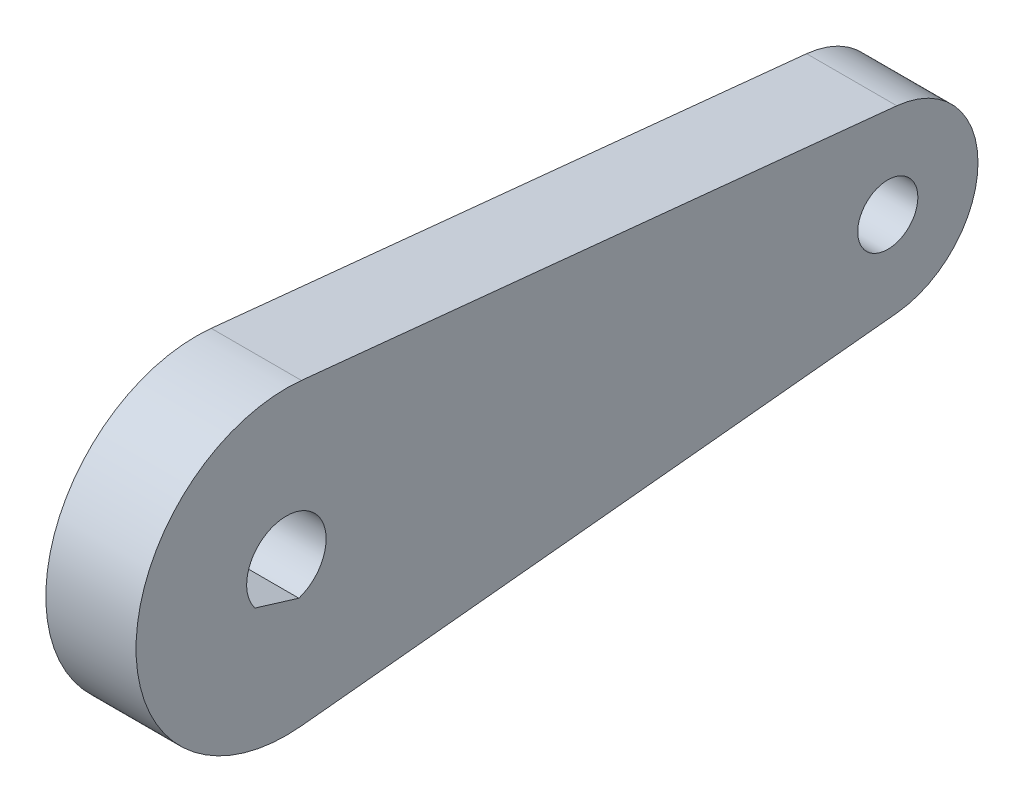
ISO-10303-21;
HEADER;
FILE_DESCRIPTION(('STEP AP214'),'2;1');
FILE_NAME('part.step','',(''),(''),'','','');
FILE_SCHEMA(('AUTOMOTIVE_DESIGN { 1 0 10303 214 1 1 1 1 }'));
ENDSEC;
DATA;
#1=APPLICATION_CONTEXT('core data for automotive mechanical design processes');
#2=APPLICATION_PROTOCOL_DEFINITION('international standard','automotive_design',2000,#1);
#3=PRODUCT_CONTEXT('',#1,'mechanical');
#4=PRODUCT('Part','Part','',(#3));
#5=PRODUCT_RELATED_PRODUCT_CATEGORY('part','',(#4));
#6=PRODUCT_DEFINITION_FORMATION('','',#4);
#7=PRODUCT_DEFINITION_CONTEXT('part definition',#1,'design');
#8=PRODUCT_DEFINITION('design','',#6,#7);
#9=PRODUCT_DEFINITION_SHAPE('','',#8);
#10=(LENGTH_UNIT() NAMED_UNIT(*) SI_UNIT(.MILLI.,.METRE.));
#11=(NAMED_UNIT(*) PLANE_ANGLE_UNIT() SI_UNIT($,.RADIAN.));
#12=(NAMED_UNIT(*) SI_UNIT($,.STERADIAN.) SOLID_ANGLE_UNIT());
#13=UNCERTAINTY_MEASURE_WITH_UNIT(LENGTH_MEASURE(1.E-05),#10,'distance_accuracy_value','');
#14=(GEOMETRIC_REPRESENTATION_CONTEXT(3) GLOBAL_UNCERTAINTY_ASSIGNED_CONTEXT((#13)) GLOBAL_UNIT_ASSIGNED_CONTEXT((#10,
#11,#12)) REPRESENTATION_CONTEXT('',''));
#15=CARTESIAN_POINT('',(0.,0.,0.));
#16=DIRECTION('',(0.,0.,1.));
#17=DIRECTION('',(1.,0.,0.));
#18=AXIS2_PLACEMENT_3D('',#15,#16,#17);
#19=CARTESIAN_POINT('',(62.4642749893234,0.,0.));
#20=DIRECTION('',(-1.,0.,0.));
#21=DIRECTION('',(0.,0.,1.));
#22=AXIS2_PLACEMENT_3D('',#19,#20,#21);
#23=CYLINDRICAL_SURFACE('',#22,10.0000000000071);
#24=CARTESIAN_POINT('',(3.,0.,0.));
#25=DIRECTION('',(1.,0.,0.));
#26=DIRECTION('',(0.,0.,-1.));
#27=AXIS2_PLACEMENT_3D('',#24,#25,#26);
#28=CIRCLE('',#27,10.0000000000071);
#29=CARTESIAN_POINT('',(3.,9.94987437101769,-1.0000000000112));
#30=VERTEX_POINT('',#29);
#31=CARTESIAN_POINT('',(3.00000000000002,-9.94987437109485,-0.99999999998613));
#32=VERTEX_POINT('',#31);
#33=EDGE_CURVE('E143',#30,#32,#28,.T.);
#34=ORIENTED_EDGE('',*,*,#33,.F.);
#35=DIRECTION('',(-1.,0.,0.));
#36=VECTOR('',#35,1.);
#37=CARTESIAN_POINT('',(62.4642749893234,9.94987437104468,-1.00000000001391));
#38=LINE('',#37,#36);
#39=CARTESIAN_POINT('',(-3.,9.94987437101769,-1.0000000000112));
#40=VERTEX_POINT('',#39);
#41=EDGE_CURVE('E135',#30,#40,#38,.T.);
#42=ORIENTED_EDGE('',*,*,#41,.T.);
#43=CARTESIAN_POINT('',(-3.,0.,0.));
#44=DIRECTION('',(1.,0.,0.));
#45=DIRECTION('',(0.,0.,-1.));
#46=AXIS2_PLACEMENT_3D('',#43,#44,#45);
#47=CIRCLE('',#46,10.0000000000071);
#48=CARTESIAN_POINT('',(-3.,-9.94987437111498,-0.99999999998613));
#49=VERTEX_POINT('',#48);
#50=EDGE_CURVE('E131',#49,#40,#47,.F.);
#51=ORIENTED_EDGE('',*,*,#50,.F.);
#52=DIRECTION('',(-1.,0.,0.));
#53=VECTOR('',#52,1.);
#54=CARTESIAN_POINT('',(62.4642749893234,-9.94987437109485,-0.99999999998613));
#55=LINE('',#54,#53);
#56=EDGE_CURVE('E147',#32,#49,#55,.T.);
#57=ORIENTED_EDGE('',*,*,#56,.F.);
#58=EDGE_LOOP('',(#34,#42,#51,#57));
#59=FACE_BOUND('',#58,.T.);
#60=ADVANCED_FACE('F45',(#59),#23,.T.);
#61=CARTESIAN_POINT('',(62.4642749893234,-9.94987437111431,-0.999999999992834));
#62=DIRECTION('',(0.,-0.994987437106739,-0.0999999999988119));
#63=DIRECTION('',(0.,0.0999999999988119,-0.994987437106739));
#64=AXIS2_PLACEMENT_3D('',#61,#62,#63);
#65=PLANE('',#64);
#66=DIRECTION('',(-1.,0.,0.));
#67=VECTOR('',#66,1.);
#68=CARTESIAN_POINT('',(62.4642749893234,-5.96992462274733,-40.6000000000081));
#69=LINE('',#68,#67);
#70=CARTESIAN_POINT('',(3.00000000000002,-5.96992462274733,-40.6000000000081));
#71=VERTEX_POINT('',#70);
#72=CARTESIAN_POINT('',(-3.00000000000002,-5.96992462274733,-40.6000000000081));
#73=VERTEX_POINT('',#72);
#74=EDGE_CURVE('E158',#71,#73,#69,.T.);
#75=ORIENTED_EDGE('',*,*,#74,.F.);
#76=DIRECTION('',(0.,-0.0999999999988119,0.994987437106739));
#77=VECTOR('',#76,1.);
#78=CARTESIAN_POINT('',(3.,-9.94987437111431,-0.999999999992834));
#79=LINE('',#78,#77);
#80=EDGE_CURVE('E144',#71,#32,#79,.T.);
#81=ORIENTED_EDGE('',*,*,#80,.T.);
#82=ORIENTED_EDGE('',*,*,#56,.T.);
#83=DIRECTION('',(0.,0.0999999999988119,-0.994987437106739));
#84=VECTOR('',#83,1.);
#85=CARTESIAN_POINT('',(-3.,-9.94987437111431,-0.999999999992834));
#86=LINE('',#85,#84);
#87=EDGE_CURVE('E122',#49,#73,#86,.T.);
#88=ORIENTED_EDGE('',*,*,#87,.T.);
#89=EDGE_LOOP('',(#75,#81,#82,#88));
#90=FACE_BOUND('',#89,.T.);
#91=ADVANCED_FACE('F187',(#90),#65,.T.);
#92=CARTESIAN_POINT('',(62.4642749893234,-9.37531303060534E-11,-40.0000000000139));
#93=DIRECTION('',(-1.,0.,0.));
#94=DIRECTION('',(0.,0.,1.));
#95=AXIS2_PLACEMENT_3D('',#92,#93,#94);
#96=CYLINDRICAL_SURFACE('',#95,6.00000000002642);
#97=CARTESIAN_POINT('',(3.,-9.37531303060534E-11,-40.0000000000139));
#98=DIRECTION('',(1.,0.,0.));
#99=DIRECTION('',(0.,0.,-1.));
#100=AXIS2_PLACEMENT_3D('',#97,#98,#99);
#101=CIRCLE('',#100,6.00000000002642);
#102=CARTESIAN_POINT('',(3.00000000000002,5.96992462255844,-40.6000000000219));
#103=VERTEX_POINT('',#102);
#104=EDGE_CURVE('E139',#71,#103,#101,.T.);
#105=ORIENTED_EDGE('',*,*,#104,.F.);
#106=ORIENTED_EDGE('',*,*,#74,.T.);
#107=CARTESIAN_POINT('',(-3.,-9.37531303060534E-11,-40.0000000000139));
#108=DIRECTION('',(1.,0.,0.));
#109=DIRECTION('',(0.,0.,-1.));
#110=AXIS2_PLACEMENT_3D('',#107,#108,#109);
#111=CIRCLE('',#110,6.00000000002642);
#112=CARTESIAN_POINT('',(-3.,5.96992462257158,-40.6000000000233));
#113=VERTEX_POINT('',#112);
#114=EDGE_CURVE('E123',#113,#73,#111,.F.);
#115=ORIENTED_EDGE('',*,*,#114,.F.);
#116=DIRECTION('',(-1.,0.,0.));
#117=VECTOR('',#116,1.);
#118=CARTESIAN_POINT('',(62.4642749893234,5.96992462255844,-40.6000000000219));
#119=LINE('',#118,#117);
#120=EDGE_CURVE('E155',#103,#113,#119,.T.);
#121=ORIENTED_EDGE('',*,*,#120,.F.);
#122=EDGE_LOOP('',(#105,#106,#115,#121));
#123=FACE_BOUND('',#122,.T.);
#124=ADVANCED_FACE('F184',(#123),#96,.T.);
#125=CARTESIAN_POINT('',(62.4642749893234,9.94987437101817,-1.00000000000647));
#126=DIRECTION('',(0.,-0.994987437106507,0.100000000001119));
#127=DIRECTION('',(0.,-0.100000000001119,-0.994987437106508));
#128=AXIS2_PLACEMENT_3D('',#125,#126,#127);
#129=PLANE('',#128);
#130=DIRECTION('',(0.,0.100000000001119,0.994987437106508));
#131=VECTOR('',#130,1.);
#132=CARTESIAN_POINT('',(3.,9.94987437101817,-1.00000000000647));
#133=LINE('',#132,#131);
#134=EDGE_CURVE('E151',#103,#30,#133,.T.);
#135=ORIENTED_EDGE('',*,*,#134,.F.);
#136=ORIENTED_EDGE('',*,*,#120,.T.);
#137=DIRECTION('',(0.,-0.100000000001119,-0.994987437106508));
#138=VECTOR('',#137,1.);
#139=CARTESIAN_POINT('',(-3.,9.94987437101817,-1.00000000000647));
#140=LINE('',#139,#138);
#141=EDGE_CURVE('E127',#40,#113,#140,.T.);
#142=ORIENTED_EDGE('',*,*,#141,.F.);
#143=ORIENTED_EDGE('',*,*,#41,.F.);
#144=EDGE_LOOP('',(#135,#136,#142,#143));
#145=FACE_BOUND('',#144,.T.);
#146=ADVANCED_FACE('F181',(#145),#129,.F.);
#147=CARTESIAN_POINT('',(3.,0.,0.));
#148=DIRECTION('',(1.,0.,0.));
#149=DIRECTION('',(0.,0.,-1.));
#150=AXIS2_PLACEMENT_3D('',#147,#148,#149);
#151=PLANE('',#150);
#152=CARTESIAN_POINT('',(3.,0.,0.));
#153=DIRECTION('',(1.,0.,0.));
#154=DIRECTION('',(0.,0.,-1.));
#155=AXIS2_PLACEMENT_3D('',#152,#153,#154);
#156=CIRCLE('',#155,2.64300000000001);
#157=CARTESIAN_POINT('',(3.,-2.50935428483646,-0.829813276088646));
#158=VERTEX_POINT('',#157);
#159=CARTESIAN_POINT('',(3.,-1.61606719642073,2.09135741006957));
#160=VERTEX_POINT('',#159);
#161=EDGE_CURVE('E61',#158,#160,#156,.T.);
#162=ORIENTED_EDGE('',*,*,#161,.F.);
#163=DIRECTION('',(0.,-0.292430258224602,-0.956286852400833));
#164=VECTOR('',#163,1.);
#165=CARTESIAN_POINT('',(3.,-1.61606719642073,2.09135741006957));
#166=LINE('',#165,#164);
#167=EDGE_CURVE('E104',#160,#158,#166,.T.);
#168=ORIENTED_EDGE('',*,*,#167,.F.);
#169=EDGE_LOOP('',(#162,#168));
#170=FACE_BOUND('',#169,.T.);
#171=CARTESIAN_POINT('',(3.00000000000002,-9.37531302591665E-11,-40.0000000000139));
#172=DIRECTION('',(1.,0.,0.));
#173=DIRECTION('',(0.,0.,-1.));
#174=AXIS2_PLACEMENT_3D('',#171,#172,#173);
#175=CIRCLE('',#174,2.);
#176=CARTESIAN_POINT('',(3.00000000000002,-9.37531302591665E-11,-42.0000000000139));
#177=VERTEX_POINT('',#176);
#178=EDGE_CURVE('E100',#177,#177,#175,.T.);
#179=ORIENTED_EDGE('',*,*,#178,.F.);
#180=EDGE_LOOP('',(#179));
#181=FACE_BOUND('',#180,.T.);
#182=ORIENTED_EDGE('',*,*,#134,.T.);
#183=ORIENTED_EDGE('',*,*,#33,.T.);
#184=ORIENTED_EDGE('',*,*,#80,.F.);
#185=ORIENTED_EDGE('',*,*,#104,.T.);
#186=EDGE_LOOP('',(#182,#183,#184,#185));
#187=FACE_BOUND('',#186,.T.);
#188=ADVANCED_FACE('F47',(#170,#181,#187),#151,.T.);
#189=CARTESIAN_POINT('',(-3.,0.,0.));
#190=DIRECTION('',(1.,0.,0.));
#191=DIRECTION('',(0.,0.,-1.));
#192=AXIS2_PLACEMENT_3D('',#189,#190,#191);
#193=PLANE('',#192);
#194=DIRECTION('',(0.,-0.292430258224602,-0.956286852400833));
#195=VECTOR('',#194,1.);
#196=CARTESIAN_POINT('',(-3.,-2.0627107406286,0.630772066990466));
#197=LINE('',#196,#195);
#198=CARTESIAN_POINT('',(-3.,-1.61606719642073,2.09135741006957));
#199=VERTEX_POINT('',#198);
#200=CARTESIAN_POINT('',(-3.,-2.50935428483646,-0.829813276088646));
#201=VERTEX_POINT('',#200);
#202=EDGE_CURVE('E54',#199,#201,#197,.T.);
#203=ORIENTED_EDGE('',*,*,#202,.T.);
#204=CARTESIAN_POINT('',(-3.,0.,0.));
#205=DIRECTION('',(1.,0.,0.));
#206=DIRECTION('',(0.,0.,-1.));
#207=AXIS2_PLACEMENT_3D('',#204,#205,#206);
#208=CIRCLE('',#207,2.64300000000001);
#209=EDGE_CURVE('E11',#201,#199,#208,.T.);
#210=ORIENTED_EDGE('',*,*,#209,.T.);
#211=EDGE_LOOP('',(#203,#210));
#212=FACE_BOUND('',#211,.T.);
#213=CARTESIAN_POINT('',(-3.00000000000002,-9.37531302591665E-11,-40.0000000000139));
#214=DIRECTION('',(1.,0.,0.));
#215=DIRECTION('',(0.,0.,-1.));
#216=AXIS2_PLACEMENT_3D('',#213,#214,#215);
#217=CIRCLE('',#216,2.);
#218=CARTESIAN_POINT('',(-3.00000000000002,-9.37531302591665E-11,-42.0000000000139));
#219=VERTEX_POINT('',#218);
#220=EDGE_CURVE('E118',#219,#219,#217,.T.);
#221=ORIENTED_EDGE('',*,*,#220,.T.);
#222=EDGE_LOOP('',(#221));
#223=FACE_BOUND('',#222,.T.);
#224=ORIENTED_EDGE('',*,*,#50,.T.);
#225=ORIENTED_EDGE('',*,*,#141,.T.);
#226=ORIENTED_EDGE('',*,*,#114,.T.);
#227=ORIENTED_EDGE('',*,*,#87,.F.);
#228=EDGE_LOOP('',(#224,#225,#226,#227));
#229=FACE_BOUND('',#228,.T.);
#230=ADVANCED_FACE('F166',(#212,#223,#229),#193,.F.);
#231=CARTESIAN_POINT('',(-3.00000000000002,-9.37531302591665E-11,-40.0000000000139));
#232=DIRECTION('',(1.,0.,0.));
#233=DIRECTION('',(0.,0.,-1.));
#234=AXIS2_PLACEMENT_3D('',#231,#232,#233);
#235=CYLINDRICAL_SURFACE('',#234,2.);
#236=ORIENTED_EDGE('',*,*,#220,.F.);
#237=EDGE_LOOP('',(#236));
#238=FACE_BOUND('',#237,.T.);
#239=ORIENTED_EDGE('',*,*,#178,.T.);
#240=EDGE_LOOP('',(#239));
#241=FACE_BOUND('',#240,.T.);
#242=ADVANCED_FACE('F169',(#238,#241),#235,.F.);
#243=CARTESIAN_POINT('',(-7.,0.,0.));
#244=DIRECTION('',(1.,0.,0.));
#245=DIRECTION('',(0.,0.,-1.));
#246=AXIS2_PLACEMENT_3D('',#243,#244,#245);
#247=CYLINDRICAL_SURFACE('',#246,2.64300000000001);
#248=DIRECTION('',(1.,0.,0.));
#249=VECTOR('',#248,1.);
#250=CARTESIAN_POINT('',(-7.,-2.50935428483646,-0.829813276088646));
#251=LINE('',#250,#249);
#252=EDGE_CURVE('E68',#201,#158,#251,.T.);
#253=ORIENTED_EDGE('',*,*,#252,.T.);
#254=ORIENTED_EDGE('',*,*,#161,.T.);
#255=DIRECTION('',(1.,0.,0.));
#256=VECTOR('',#255,1.);
#257=CARTESIAN_POINT('',(-7.,-1.61606719642073,2.09135741006957));
#258=LINE('',#257,#256);
#259=EDGE_CURVE('E101',#199,#160,#258,.T.);
#260=ORIENTED_EDGE('',*,*,#259,.F.);
#261=ORIENTED_EDGE('',*,*,#209,.F.);
#262=EDGE_LOOP('',(#253,#254,#260,#261));
#263=FACE_BOUND('',#262,.T.);
#264=ADVANCED_FACE('F97',(#263),#247,.F.);
#265=CARTESIAN_POINT('',(-7.,-1.61606719642073,2.09135741006957));
#266=DIRECTION('',(0.,-0.956286852400833,0.292430258224602));
#267=DIRECTION('',(0.,-0.292430258224602,-0.956286852400833));
#268=AXIS2_PLACEMENT_3D('',#265,#266,#267);
#269=PLANE('',#268);
#270=ORIENTED_EDGE('',*,*,#259,.T.);
#271=ORIENTED_EDGE('',*,*,#167,.T.);
#272=ORIENTED_EDGE('',*,*,#252,.F.);
#273=ORIENTED_EDGE('',*,*,#202,.F.);
#274=EDGE_LOOP('',(#270,#271,#272,#273));
#275=FACE_BOUND('',#274,.T.);
#276=ADVANCED_FACE('F105',(#275),#269,.F.);
#277=CLOSED_SHELL('',(#60,#91,#124,#146,#188,#230,#242,#264,#276));
#278=MANIFOLD_SOLID_BREP('B2',#277);
#279=ADVANCED_BREP_SHAPE_REPRESENTATION('',(#18,#278),#14);
#280=SHAPE_DEFINITION_REPRESENTATION(#9,#279);
ENDSEC;
END-ISO-10303-21;
